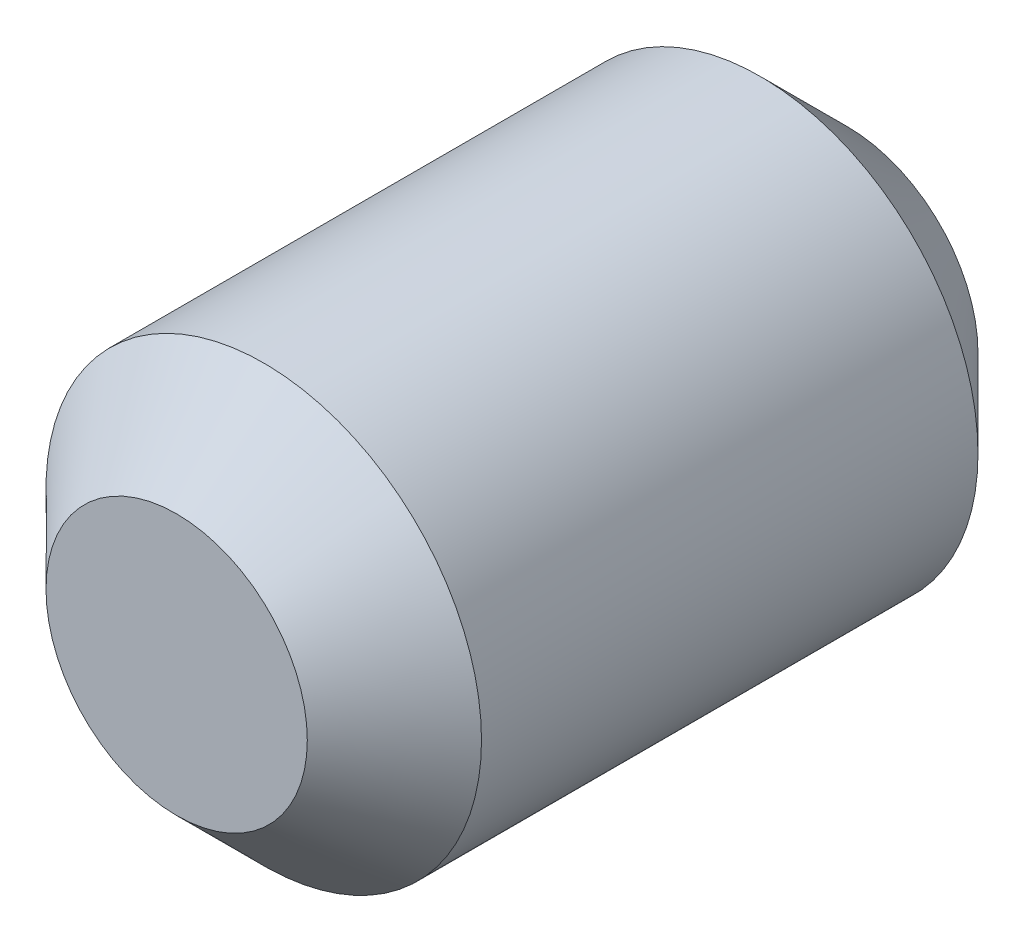
ISO-10303-21;
HEADER;
FILE_DESCRIPTION(('STEP AP214'),'2;1');
FILE_NAME('part.step','',(''),(''),'','','');
FILE_SCHEMA(('AUTOMOTIVE_DESIGN { 1 0 10303 214 1 1 1 1 }'));
ENDSEC;
DATA;
#1=APPLICATION_CONTEXT('core data for automotive mechanical design processes');
#2=APPLICATION_PROTOCOL_DEFINITION('international standard','automotive_design',2000,#1);
#3=PRODUCT_CONTEXT('',#1,'mechanical');
#4=PRODUCT('Part','Part','',(#3));
#5=PRODUCT_RELATED_PRODUCT_CATEGORY('part','',(#4));
#6=PRODUCT_DEFINITION_FORMATION('','',#4);
#7=PRODUCT_DEFINITION_CONTEXT('part definition',#1,'design');
#8=PRODUCT_DEFINITION('design','',#6,#7);
#9=PRODUCT_DEFINITION_SHAPE('','',#8);
#10=(LENGTH_UNIT() NAMED_UNIT(*) SI_UNIT(.MILLI.,.METRE.));
#11=(NAMED_UNIT(*) PLANE_ANGLE_UNIT() SI_UNIT($,.RADIAN.));
#12=(NAMED_UNIT(*) SI_UNIT($,.STERADIAN.) SOLID_ANGLE_UNIT());
#13=UNCERTAINTY_MEASURE_WITH_UNIT(LENGTH_MEASURE(1.E-05),#10,'distance_accuracy_value','');
#14=(GEOMETRIC_REPRESENTATION_CONTEXT(3) GLOBAL_UNCERTAINTY_ASSIGNED_CONTEXT((#13)) GLOBAL_UNIT_ASSIGNED_CONTEXT((#10,
#11,#12)) REPRESENTATION_CONTEXT('',''));
#15=CARTESIAN_POINT('',(0.,0.,0.));
#16=DIRECTION('',(0.,0.,1.));
#17=DIRECTION('',(1.,0.,0.));
#18=AXIS2_PLACEMENT_3D('',#15,#16,#17);
#19=CARTESIAN_POINT('',(0.,0.,3.85));
#20=DIRECTION('',(0.,0.,-1.));
#21=DIRECTION('',(-1.,0.,0.));
#22=AXIS2_PLACEMENT_3D('',#19,#20,#21);
#23=CYLINDRICAL_SURFACE('',#22,2.5);
#24=CARTESIAN_POINT('',(0.,0.,2.84999999999998));
#25=DIRECTION('',(0.,0.,1.));
#26=DIRECTION('',(1.,0.,0.));
#27=AXIS2_PLACEMENT_3D('',#24,#25,#26);
#28=CIRCLE('',#27,2.5);
#29=CARTESIAN_POINT('',(2.5,0.,2.84999999999998));
#30=VERTEX_POINT('',#29);
#31=EDGE_CURVE('E34',#30,#30,#28,.F.);
#32=ORIENTED_EDGE('',*,*,#31,.T.);
#33=EDGE_LOOP('',(#32));
#34=FACE_BOUND('',#33,.T.);
#35=CARTESIAN_POINT('',(0.,0.,-2.84999999999998));
#36=DIRECTION('',(0.,0.,1.));
#37=DIRECTION('',(1.,0.,0.));
#38=AXIS2_PLACEMENT_3D('',#35,#36,#37);
#39=CIRCLE('',#38,2.5);
#40=CARTESIAN_POINT('',(2.5,0.,-2.84999999999998));
#41=VERTEX_POINT('',#40);
#42=EDGE_CURVE('E38',#41,#41,#39,.T.);
#43=ORIENTED_EDGE('',*,*,#42,.T.);
#44=EDGE_LOOP('',(#43));
#45=FACE_BOUND('',#44,.T.);
#46=ADVANCED_FACE('F28',(#34,#45),#23,.T.);
#47=CARTESIAN_POINT('',(0.,0.,3.85));
#48=DIRECTION('',(0.,0.,1.));
#49=DIRECTION('',(1.,0.,0.));
#50=AXIS2_PLACEMENT_3D('',#47,#48,#49);
#51=PLANE('',#50);
#52=CARTESIAN_POINT('',(0.,0.,3.85));
#53=DIRECTION('',(0.,0.,1.));
#54=DIRECTION('',(1.,0.,0.));
#55=AXIS2_PLACEMENT_3D('',#52,#53,#54);
#56=CIRCLE('',#55,1.49999999999999);
#57=CARTESIAN_POINT('',(1.49999999999999,0.,3.85));
#58=VERTEX_POINT('',#57);
#59=EDGE_CURVE('E42',#58,#58,#56,.T.);
#60=ORIENTED_EDGE('',*,*,#59,.T.);
#61=EDGE_LOOP('',(#60));
#62=FACE_BOUND('',#61,.T.);
#63=ADVANCED_FACE('F48',(#62),#51,.T.);
#64=CARTESIAN_POINT('',(0.,0.,-3.85));
#65=DIRECTION('',(0.,0.,1.));
#66=DIRECTION('',(1.,0.,0.));
#67=AXIS2_PLACEMENT_3D('',#64,#65,#66);
#68=PLANE('',#67);
#69=CARTESIAN_POINT('',(0.,0.,-3.85));
#70=DIRECTION('',(0.,0.,1.));
#71=DIRECTION('',(1.,0.,0.));
#72=AXIS2_PLACEMENT_3D('',#69,#70,#71);
#73=CIRCLE('',#72,1.49999999999999);
#74=CARTESIAN_POINT('',(1.49999999999999,0.,-3.85));
#75=VERTEX_POINT('',#74);
#76=EDGE_CURVE('E10',#75,#75,#73,.F.);
#77=ORIENTED_EDGE('',*,*,#76,.T.);
#78=EDGE_LOOP('',(#77));
#79=FACE_BOUND('',#78,.T.);
#80=ADVANCED_FACE('F53',(#79),#68,.F.);
#81=CARTESIAN_POINT('',(0.,0.,3.85));
#82=DIRECTION('',(0.,0.,-1.));
#83=DIRECTION('',(-1.,0.,0.));
#84=AXIS2_PLACEMENT_3D('',#81,#82,#83);
#85=CONICAL_SURFACE('',#84,1.49999999999999,0.785398163397443);
#86=ORIENTED_EDGE('',*,*,#31,.F.);
#87=EDGE_LOOP('',(#86));
#88=FACE_BOUND('',#87,.T.);
#89=ORIENTED_EDGE('',*,*,#59,.F.);
#90=EDGE_LOOP('',(#89));
#91=FACE_BOUND('',#90,.T.);
#92=ADVANCED_FACE('F50',(#88,#91),#85,.T.);
#93=CARTESIAN_POINT('',(0.,0.,-2.84999999999998));
#94=DIRECTION('',(0.,0.,1.));
#95=DIRECTION('',(1.,0.,0.));
#96=AXIS2_PLACEMENT_3D('',#93,#94,#95);
#97=CONICAL_SURFACE('',#96,2.5,0.785398163397443);
#98=ORIENTED_EDGE('',*,*,#76,.F.);
#99=EDGE_LOOP('',(#98));
#100=FACE_BOUND('',#99,.T.);
#101=ORIENTED_EDGE('',*,*,#42,.F.);
#102=EDGE_LOOP('',(#101));
#103=FACE_BOUND('',#102,.T.);
#104=ADVANCED_FACE('F52',(#100,#103),#97,.T.);
#105=CLOSED_SHELL('',(#46,#63,#80,#92,#104));
#106=MANIFOLD_SOLID_BREP('B2',#105);
#107=ADVANCED_BREP_SHAPE_REPRESENTATION('',(#18,#106),#14);
#108=SHAPE_DEFINITION_REPRESENTATION(#9,#107);
ENDSEC;
END-ISO-10303-21;
